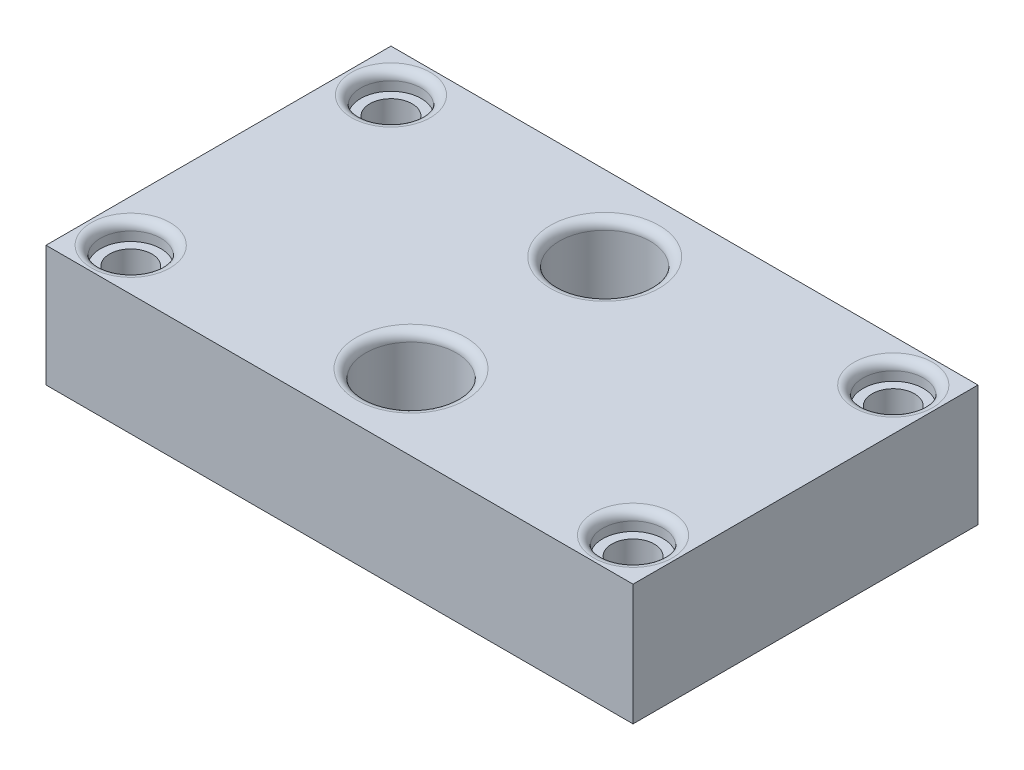
ISO-10303-21;
HEADER;
FILE_DESCRIPTION(('STEP AP214'),'2;1');
FILE_NAME('part.step','',(''),(''),'','','');
FILE_SCHEMA(('AUTOMOTIVE_DESIGN { 1 0 10303 214 1 1 1 1 }'));
ENDSEC;
DATA;
#1=APPLICATION_CONTEXT('core data for automotive mechanical design processes');
#2=APPLICATION_PROTOCOL_DEFINITION('international standard','automotive_design',2000,#1);
#3=PRODUCT_CONTEXT('',#1,'mechanical');
#4=PRODUCT('Part','Part','',(#3));
#5=PRODUCT_RELATED_PRODUCT_CATEGORY('part','',(#4));
#6=PRODUCT_DEFINITION_FORMATION('','',#4);
#7=PRODUCT_DEFINITION_CONTEXT('part definition',#1,'design');
#8=PRODUCT_DEFINITION('design','',#6,#7);
#9=PRODUCT_DEFINITION_SHAPE('','',#8);
#10=(LENGTH_UNIT() NAMED_UNIT(*) SI_UNIT(.MILLI.,.METRE.));
#11=(NAMED_UNIT(*) PLANE_ANGLE_UNIT() SI_UNIT($,.RADIAN.));
#12=(NAMED_UNIT(*) SI_UNIT($,.STERADIAN.) SOLID_ANGLE_UNIT());
#13=UNCERTAINTY_MEASURE_WITH_UNIT(LENGTH_MEASURE(1.E-05),#10,'distance_accuracy_value','');
#14=(GEOMETRIC_REPRESENTATION_CONTEXT(3) GLOBAL_UNCERTAINTY_ASSIGNED_CONTEXT((#13)) GLOBAL_UNIT_ASSIGNED_CONTEXT((#10,
#11,#12)) REPRESENTATION_CONTEXT('',''));
#15=CARTESIAN_POINT('',(0.,0.,0.));
#16=DIRECTION('',(0.,0.,1.));
#17=DIRECTION('',(1.,0.,0.));
#18=AXIS2_PLACEMENT_3D('',#15,#16,#17);
#19=CARTESIAN_POINT('',(-527.259361974666,535.957940223895,-28.5));
#20=DIRECTION('',(0.,0.,1.));
#21=DIRECTION('',(1.,0.,0.));
#22=AXIS2_PLACEMENT_3D('',#19,#20,#21);
#23=PLANE('',#22);
#24=DIRECTION('',(-1.,0.,0.));
#25=VECTOR('',#24,1.);
#26=CARTESIAN_POINT('',(-527.259361974666,515.957940223895,-28.5));
#27=LINE('',#26,#25);
#28=CARTESIAN_POINT('',(-527.259361974666,515.957940223895,-28.5));
#29=VERTEX_POINT('',#28);
#30=CARTESIAN_POINT('',(-624.259361974666,515.957940223895,-28.5));
#31=VERTEX_POINT('',#30);
#32=EDGE_CURVE('E100',#29,#31,#27,.T.);
#33=ORIENTED_EDGE('',*,*,#32,.T.);
#34=DIRECTION('',(0.,-1.,0.));
#35=VECTOR('',#34,1.);
#36=CARTESIAN_POINT('',(-624.259361974666,535.957940223895,-28.5));
#37=LINE('',#36,#35);
#38=CARTESIAN_POINT('',(-624.259361974666,535.957940223895,-28.5));
#39=VERTEX_POINT('',#38);
#40=EDGE_CURVE('E91',#39,#31,#37,.T.);
#41=ORIENTED_EDGE('',*,*,#40,.F.);
#42=DIRECTION('',(-1.,0.,0.));
#43=VECTOR('',#42,1.);
#44=CARTESIAN_POINT('',(-527.259361974666,535.957940223895,-28.5));
#45=LINE('',#44,#43);
#46=CARTESIAN_POINT('',(-527.259361974666,535.957940223895,-28.5));
#47=VERTEX_POINT('',#46);
#48=EDGE_CURVE('E85',#47,#39,#45,.T.);
#49=ORIENTED_EDGE('',*,*,#48,.F.);
#50=DIRECTION('',(0.,-1.,0.));
#51=VECTOR('',#50,1.);
#52=CARTESIAN_POINT('',(-527.259361974666,535.957940223895,-28.5));
#53=LINE('',#52,#51);
#54=EDGE_CURVE('E96',#47,#29,#53,.T.);
#55=ORIENTED_EDGE('',*,*,#54,.T.);
#56=EDGE_LOOP('',(#33,#41,#49,#55));
#57=FACE_BOUND('',#56,.T.);
#58=ADVANCED_FACE('F32',(#57),#23,.F.);
#59=CARTESIAN_POINT('',(-624.259361974666,535.957940223895,-28.5));
#60=DIRECTION('',(1.,0.,0.));
#61=DIRECTION('',(0.,0.,-1.));
#62=AXIS2_PLACEMENT_3D('',#59,#60,#61);
#63=PLANE('',#62);
#64=DIRECTION('',(0.,0.,1.));
#65=VECTOR('',#64,1.);
#66=CARTESIAN_POINT('',(-624.259361974666,515.957940223895,-28.5));
#67=LINE('',#66,#65);
#68=CARTESIAN_POINT('',(-624.259361974666,515.957940223895,28.5));
#69=VERTEX_POINT('',#68);
#70=EDGE_CURVE('E90',#31,#69,#67,.T.);
#71=ORIENTED_EDGE('',*,*,#70,.T.);
#72=DIRECTION('',(0.,-1.,0.));
#73=VECTOR('',#72,1.);
#74=CARTESIAN_POINT('',(-624.259361974666,535.957940223895,28.5));
#75=LINE('',#74,#73);
#76=CARTESIAN_POINT('',(-624.259361974666,535.957940223895,28.5));
#77=VERTEX_POINT('',#76);
#78=EDGE_CURVE('E88',#77,#69,#75,.T.);
#79=ORIENTED_EDGE('',*,*,#78,.F.);
#80=DIRECTION('',(0.,0.,1.));
#81=VECTOR('',#80,1.);
#82=CARTESIAN_POINT('',(-624.259361974666,535.957940223895,-28.5));
#83=LINE('',#82,#81);
#84=EDGE_CURVE('E80',#39,#77,#83,.T.);
#85=ORIENTED_EDGE('',*,*,#84,.F.);
#86=ORIENTED_EDGE('',*,*,#40,.T.);
#87=EDGE_LOOP('',(#71,#79,#85,#86));
#88=FACE_BOUND('',#87,.T.);
#89=ADVANCED_FACE('F89',(#88),#63,.F.);
#90=CARTESIAN_POINT('',(-624.259361974666,535.957940223895,28.5));
#91=DIRECTION('',(0.,0.,-1.));
#92=DIRECTION('',(-1.,0.,0.));
#93=AXIS2_PLACEMENT_3D('',#90,#91,#92);
#94=PLANE('',#93);
#95=DIRECTION('',(1.,0.,0.));
#96=VECTOR('',#95,1.);
#97=CARTESIAN_POINT('',(-624.259361974666,515.957940223895,28.5));
#98=LINE('',#97,#96);
#99=CARTESIAN_POINT('',(-527.259361974666,515.957940223895,28.5));
#100=VERTEX_POINT('',#99);
#101=EDGE_CURVE('E66',#69,#100,#98,.T.);
#102=ORIENTED_EDGE('',*,*,#101,.T.);
#103=DIRECTION('',(0.,-1.,0.));
#104=VECTOR('',#103,1.);
#105=CARTESIAN_POINT('',(-527.259361974666,535.957940223895,28.5));
#106=LINE('',#105,#104);
#107=CARTESIAN_POINT('',(-527.259361974666,535.957940223895,28.5));
#108=VERTEX_POINT('',#107);
#109=EDGE_CURVE('E92',#108,#100,#106,.T.);
#110=ORIENTED_EDGE('',*,*,#109,.F.);
#111=DIRECTION('',(1.,0.,0.));
#112=VECTOR('',#111,1.);
#113=CARTESIAN_POINT('',(-624.259361974666,535.957940223895,28.5));
#114=LINE('',#113,#112);
#115=EDGE_CURVE('E83',#77,#108,#114,.T.);
#116=ORIENTED_EDGE('',*,*,#115,.F.);
#117=ORIENTED_EDGE('',*,*,#78,.T.);
#118=EDGE_LOOP('',(#102,#110,#116,#117));
#119=FACE_BOUND('',#118,.T.);
#120=ADVANCED_FACE('F94',(#119),#94,.F.);
#121=CARTESIAN_POINT('',(-527.259361974666,535.957940223895,28.5));
#122=DIRECTION('',(-1.,0.,0.));
#123=DIRECTION('',(0.,0.,1.));
#124=AXIS2_PLACEMENT_3D('',#121,#122,#123);
#125=PLANE('',#124);
#126=DIRECTION('',(0.,0.,-1.));
#127=VECTOR('',#126,1.);
#128=CARTESIAN_POINT('',(-527.259361974666,515.957940223895,28.5));
#129=LINE('',#128,#127);
#130=EDGE_CURVE('E72',#100,#29,#129,.T.);
#131=ORIENTED_EDGE('',*,*,#130,.T.);
#132=ORIENTED_EDGE('',*,*,#54,.F.);
#133=DIRECTION('',(0.,0.,-1.));
#134=VECTOR('',#133,1.);
#135=CARTESIAN_POINT('',(-527.259361974666,535.957940223895,28.5));
#136=LINE('',#135,#134);
#137=EDGE_CURVE('E49',#108,#47,#136,.T.);
#138=ORIENTED_EDGE('',*,*,#137,.F.);
#139=ORIENTED_EDGE('',*,*,#109,.T.);
#140=EDGE_LOOP('',(#131,#132,#138,#139));
#141=FACE_BOUND('',#140,.T.);
#142=ADVANCED_FACE('F276',(#141),#125,.F.);
#143=CARTESIAN_POINT('',(0.,535.957940223895,0.));
#144=DIRECTION('',(0.,1.,0.));
#145=DIRECTION('',(0.,0.,1.));
#146=AXIS2_PLACEMENT_3D('',#143,#144,#145);
#147=PLANE('',#146);
#148=CARTESIAN_POINT('',(-617.259361974666,535.957940223895,21.5000000000001));
#149=DIRECTION('',(0.,1.,0.));
#150=DIRECTION('',(0.,0.,1.));
#151=AXIS2_PLACEMENT_3D('',#148,#149,#150);
#152=CIRCLE('',#151,6.50000000000004);
#153=CARTESIAN_POINT('',(-617.259361974666,535.957940223895,28.0000000000002));
#154=VERTEX_POINT('',#153);
#155=EDGE_CURVE('E142',#154,#154,#152,.F.);
#156=ORIENTED_EDGE('',*,*,#155,.T.);
#157=EDGE_LOOP('',(#156));
#158=FACE_BOUND('',#157,.T.);
#159=CARTESIAN_POINT('',(-617.259361974666,535.957940223895,-21.5000000000002));
#160=DIRECTION('',(0.,1.,0.));
#161=DIRECTION('',(0.,0.,1.));
#162=AXIS2_PLACEMENT_3D('',#159,#160,#161);
#163=CIRCLE('',#162,6.50000000000004);
#164=CARTESIAN_POINT('',(-617.259361974666,535.957940223895,-15.0000000000001));
#165=VERTEX_POINT('',#164);
#166=EDGE_CURVE('E139',#165,#165,#163,.F.);
#167=ORIENTED_EDGE('',*,*,#166,.T.);
#168=EDGE_LOOP('',(#167));
#169=FACE_BOUND('',#168,.T.);
#170=CARTESIAN_POINT('',(-534.259361974666,535.957940223895,-21.5));
#171=DIRECTION('',(0.,1.,0.));
#172=DIRECTION('',(0.,0.,1.));
#173=AXIS2_PLACEMENT_3D('',#170,#171,#172);
#174=CIRCLE('',#173,6.50000000000004);
#175=CARTESIAN_POINT('',(-534.259361974666,535.957940223895,-15.));
#176=VERTEX_POINT('',#175);
#177=EDGE_CURVE('E136',#176,#176,#174,.F.);
#178=ORIENTED_EDGE('',*,*,#177,.T.);
#179=EDGE_LOOP('',(#178));
#180=FACE_BOUND('',#179,.T.);
#181=CARTESIAN_POINT('',(-534.259361974666,535.957940223895,21.5));
#182=DIRECTION('',(0.,1.,0.));
#183=DIRECTION('',(0.,0.,1.));
#184=AXIS2_PLACEMENT_3D('',#181,#182,#183);
#185=CIRCLE('',#184,6.50000000000004);
#186=CARTESIAN_POINT('',(-534.259361974666,535.957940223895,28.));
#187=VERTEX_POINT('',#186);
#188=EDGE_CURVE('E133',#187,#187,#185,.F.);
#189=ORIENTED_EDGE('',*,*,#188,.T.);
#190=EDGE_LOOP('',(#189));
#191=FACE_BOUND('',#190,.T.);
#192=CARTESIAN_POINT('',(-576.441550420573,535.957940223895,16.));
#193=DIRECTION('',(0.,1.,0.));
#194=DIRECTION('',(0.,0.,1.));
#195=AXIS2_PLACEMENT_3D('',#192,#193,#194);
#196=CIRCLE('',#195,8.99999999999995);
#197=CARTESIAN_POINT('',(-576.441550420573,535.957940223895,25.));
#198=VERTEX_POINT('',#197);
#199=EDGE_CURVE('E130',#198,#198,#196,.F.);
#200=ORIENTED_EDGE('',*,*,#199,.T.);
#201=EDGE_LOOP('',(#200));
#202=FACE_BOUND('',#201,.T.);
#203=CARTESIAN_POINT('',(-576.441550420573,535.957940223895,-16.));
#204=DIRECTION('',(0.,1.,0.));
#205=DIRECTION('',(0.,0.,1.));
#206=AXIS2_PLACEMENT_3D('',#203,#204,#205);
#207=CIRCLE('',#206,8.99999999999995);
#208=CARTESIAN_POINT('',(-576.441550420573,535.957940223895,-7.00000000000002));
#209=VERTEX_POINT('',#208);
#210=EDGE_CURVE('E127',#209,#209,#207,.F.);
#211=ORIENTED_EDGE('',*,*,#210,.T.);
#212=EDGE_LOOP('',(#211));
#213=FACE_BOUND('',#212,.T.);
#214=ORIENTED_EDGE('',*,*,#48,.T.);
#215=ORIENTED_EDGE('',*,*,#84,.T.);
#216=ORIENTED_EDGE('',*,*,#115,.T.);
#217=ORIENTED_EDGE('',*,*,#137,.T.);
#218=EDGE_LOOP('',(#214,#215,#216,#217));
#219=FACE_BOUND('',#218,.T.);
#220=ADVANCED_FACE('F81',(#158,#169,#180,#191,#202,#213,#219),#147,.T.);
#221=CARTESIAN_POINT('',(0.,515.957940223895,0.));
#222=DIRECTION('',(0.,1.,0.));
#223=DIRECTION('',(0.,0.,1.));
#224=AXIS2_PLACEMENT_3D('',#221,#222,#223);
#225=PLANE('',#224);
#226=CARTESIAN_POINT('',(-576.441550420573,515.957940223895,-16.));
#227=DIRECTION('',(0.,1.,0.));
#228=DIRECTION('',(0.,0.,1.));
#229=AXIS2_PLACEMENT_3D('',#226,#227,#228);
#230=CIRCLE('',#229,7.49999999999995);
#231=CARTESIAN_POINT('',(-576.441550420573,515.957940223895,-8.50000000000002));
#232=VERTEX_POINT('',#231);
#233=EDGE_CURVE('E406',#232,#232,#230,.T.);
#234=ORIENTED_EDGE('',*,*,#233,.T.);
#235=EDGE_LOOP('',(#234));
#236=FACE_BOUND('',#235,.T.);
#237=CARTESIAN_POINT('',(-576.441550420573,515.957940223895,16.));
#238=DIRECTION('',(0.,1.,0.));
#239=DIRECTION('',(0.,0.,1.));
#240=AXIS2_PLACEMENT_3D('',#237,#238,#239);
#241=CIRCLE('',#240,7.49999999999995);
#242=CARTESIAN_POINT('',(-576.441550420573,515.957940223895,23.5));
#243=VERTEX_POINT('',#242);
#244=EDGE_CURVE('E407',#243,#243,#241,.T.);
#245=ORIENTED_EDGE('',*,*,#244,.T.);
#246=EDGE_LOOP('',(#245));
#247=FACE_BOUND('',#246,.T.);
#248=ORIENTED_EDGE('',*,*,#32,.F.);
#249=ORIENTED_EDGE('',*,*,#130,.F.);
#250=ORIENTED_EDGE('',*,*,#101,.F.);
#251=ORIENTED_EDGE('',*,*,#70,.F.);
#252=EDGE_LOOP('',(#248,#249,#250,#251));
#253=FACE_BOUND('',#252,.T.);
#254=ADVANCED_FACE('F275',(#236,#247,#253),#225,.F.);
#255=CARTESIAN_POINT('',(-617.259361974666,532.957940223895,-21.5000000000002));
#256=DIRECTION('',(0.,1.,0.));
#257=DIRECTION('',(0.,0.,1.));
#258=AXIS2_PLACEMENT_3D('',#255,#256,#257);
#259=PLANE('',#258);
#260=CARTESIAN_POINT('',(-617.259361974666,532.957940223895,-21.5000000000002));
#261=DIRECTION('',(0.,1.,0.));
#262=DIRECTION('',(0.,0.,1.));
#263=AXIS2_PLACEMENT_3D('',#260,#261,#262);
#264=CIRCLE('',#263,5.00000000000004);
#265=CARTESIAN_POINT('',(-617.259361974666,532.957940223895,-16.5000000000001));
#266=VERTEX_POINT('',#265);
#267=EDGE_CURVE('E207',#266,#266,#264,.T.);
#268=ORIENTED_EDGE('',*,*,#267,.T.);
#269=EDGE_LOOP('',(#268));
#270=FACE_BOUND('',#269,.T.);
#271=CARTESIAN_POINT('',(-617.259361974666,532.957940223895,-21.5000000000002));
#272=DIRECTION('',(0.,1.,0.));
#273=DIRECTION('',(0.,0.,1.));
#274=AXIS2_PLACEMENT_3D('',#271,#272,#273);
#275=CIRCLE('',#274,3.49999999999997);
#276=CARTESIAN_POINT('',(-617.259361974666,532.957940223895,-18.0000000000002));
#277=VERTEX_POINT('',#276);
#278=EDGE_CURVE('E111',#277,#277,#275,.F.);
#279=ORIENTED_EDGE('',*,*,#278,.T.);
#280=EDGE_LOOP('',(#279));
#281=FACE_BOUND('',#280,.T.);
#282=ADVANCED_FACE('F280',(#270,#281),#259,.T.);
#283=CARTESIAN_POINT('',(-617.259361974666,532.957940223895,-21.5000000000002));
#284=DIRECTION('',(0.,1.,0.));
#285=DIRECTION('',(0.,0.,1.));
#286=AXIS2_PLACEMENT_3D('',#283,#284,#285);
#287=CYLINDRICAL_SURFACE('',#286,5.00000000000004);
#288=CARTESIAN_POINT('',(-617.259361974666,534.457940223895,-21.5000000000002));
#289=DIRECTION('',(0.,1.,0.));
#290=DIRECTION('',(0.,0.,1.));
#291=AXIS2_PLACEMENT_3D('',#288,#289,#290);
#292=CIRCLE('',#291,5.00000000000004);
#293=CARTESIAN_POINT('',(-617.259361974666,534.457940223895,-16.5000000000001));
#294=VERTEX_POINT('',#293);
#295=EDGE_CURVE('E145',#294,#294,#292,.T.);
#296=ORIENTED_EDGE('',*,*,#295,.T.);
#297=EDGE_LOOP('',(#296));
#298=FACE_BOUND('',#297,.T.);
#299=ORIENTED_EDGE('',*,*,#267,.F.);
#300=EDGE_LOOP('',(#299));
#301=FACE_BOUND('',#300,.T.);
#302=ADVANCED_FACE('F309',(#298,#301),#287,.F.);
#303=CARTESIAN_POINT('',(-534.259361974666,532.957940223895,21.5));
#304=DIRECTION('',(0.,1.,0.));
#305=DIRECTION('',(0.,0.,1.));
#306=AXIS2_PLACEMENT_3D('',#303,#304,#305);
#307=PLANE('',#306);
#308=CARTESIAN_POINT('',(-534.259361974666,532.957940223895,21.5));
#309=DIRECTION('',(0.,1.,0.));
#310=DIRECTION('',(0.,0.,1.));
#311=AXIS2_PLACEMENT_3D('',#308,#309,#310);
#312=CIRCLE('',#311,5.00000000000004);
#313=CARTESIAN_POINT('',(-534.259361974666,532.957940223895,26.5));
#314=VERTEX_POINT('',#313);
#315=EDGE_CURVE('E214',#314,#314,#312,.T.);
#316=ORIENTED_EDGE('',*,*,#315,.T.);
#317=EDGE_LOOP('',(#316));
#318=FACE_BOUND('',#317,.T.);
#319=CARTESIAN_POINT('',(-534.259361974666,532.957940223895,21.5));
#320=DIRECTION('',(0.,1.,0.));
#321=DIRECTION('',(0.,0.,1.));
#322=AXIS2_PLACEMENT_3D('',#319,#320,#321);
#323=CIRCLE('',#322,3.49999999999996);
#324=CARTESIAN_POINT('',(-534.259361974666,532.957940223895,24.9999999999999));
#325=VERTEX_POINT('',#324);
#326=EDGE_CURVE('E114',#325,#325,#323,.F.);
#327=ORIENTED_EDGE('',*,*,#326,.T.);
#328=EDGE_LOOP('',(#327));
#329=FACE_BOUND('',#328,.T.);
#330=ADVANCED_FACE('F318',(#318,#329),#307,.T.);
#331=CARTESIAN_POINT('',(-534.259361974666,532.957940223895,21.5));
#332=DIRECTION('',(0.,1.,0.));
#333=DIRECTION('',(0.,0.,1.));
#334=AXIS2_PLACEMENT_3D('',#331,#332,#333);
#335=CYLINDRICAL_SURFACE('',#334,5.00000000000004);
#336=CARTESIAN_POINT('',(-534.259361974666,534.457940223895,21.5));
#337=DIRECTION('',(0.,1.,0.));
#338=DIRECTION('',(0.,0.,1.));
#339=AXIS2_PLACEMENT_3D('',#336,#337,#338);
#340=CIRCLE('',#339,5.00000000000004);
#341=CARTESIAN_POINT('',(-534.259361974666,534.457940223895,26.5));
#342=VERTEX_POINT('',#341);
#343=EDGE_CURVE('E151',#342,#342,#340,.T.);
#344=ORIENTED_EDGE('',*,*,#343,.T.);
#345=EDGE_LOOP('',(#344));
#346=FACE_BOUND('',#345,.T.);
#347=ORIENTED_EDGE('',*,*,#315,.F.);
#348=EDGE_LOOP('',(#347));
#349=FACE_BOUND('',#348,.T.);
#350=ADVANCED_FACE('F245',(#346,#349),#335,.F.);
#351=CARTESIAN_POINT('',(-617.259361974666,532.957940223895,21.5000000000001));
#352=DIRECTION('',(0.,1.,0.));
#353=DIRECTION('',(0.,0.,1.));
#354=AXIS2_PLACEMENT_3D('',#351,#352,#353);
#355=PLANE('',#354);
#356=CARTESIAN_POINT('',(-617.259361974666,532.957940223895,21.5000000000001));
#357=DIRECTION('',(0.,1.,0.));
#358=DIRECTION('',(0.,0.,1.));
#359=AXIS2_PLACEMENT_3D('',#356,#357,#358);
#360=CIRCLE('',#359,5.00000000000004);
#361=CARTESIAN_POINT('',(-617.259361974666,532.957940223895,26.5000000000002));
#362=VERTEX_POINT('',#361);
#363=EDGE_CURVE('E210',#362,#362,#360,.T.);
#364=ORIENTED_EDGE('',*,*,#363,.T.);
#365=EDGE_LOOP('',(#364));
#366=FACE_BOUND('',#365,.T.);
#367=CARTESIAN_POINT('',(-617.259361974666,532.957940223895,21.5000000000001));
#368=DIRECTION('',(0.,1.,0.));
#369=DIRECTION('',(0.,0.,1.));
#370=AXIS2_PLACEMENT_3D('',#367,#368,#369);
#371=CIRCLE('',#370,3.49999999999997);
#372=CARTESIAN_POINT('',(-617.259361974666,532.957940223895,25.0000000000001));
#373=VERTEX_POINT('',#372);
#374=EDGE_CURVE('E118',#373,#373,#371,.F.);
#375=ORIENTED_EDGE('',*,*,#374,.T.);
#376=EDGE_LOOP('',(#375));
#377=FACE_BOUND('',#376,.T.);
#378=ADVANCED_FACE('F241',(#366,#377),#355,.T.);
#379=CARTESIAN_POINT('',(-617.259361974666,532.957940223895,21.5000000000001));
#380=DIRECTION('',(0.,1.,0.));
#381=DIRECTION('',(0.,0.,1.));
#382=AXIS2_PLACEMENT_3D('',#379,#380,#381);
#383=CYLINDRICAL_SURFACE('',#382,5.00000000000004);
#384=CARTESIAN_POINT('',(-617.259361974666,534.457940223895,21.5000000000001));
#385=DIRECTION('',(0.,1.,0.));
#386=DIRECTION('',(0.,0.,1.));
#387=AXIS2_PLACEMENT_3D('',#384,#385,#386);
#388=CIRCLE('',#387,5.00000000000004);
#389=CARTESIAN_POINT('',(-617.259361974666,534.457940223895,26.5000000000002));
#390=VERTEX_POINT('',#389);
#391=EDGE_CURVE('E110',#390,#390,#388,.T.);
#392=ORIENTED_EDGE('',*,*,#391,.T.);
#393=EDGE_LOOP('',(#392));
#394=FACE_BOUND('',#393,.T.);
#395=ORIENTED_EDGE('',*,*,#363,.F.);
#396=EDGE_LOOP('',(#395));
#397=FACE_BOUND('',#396,.T.);
#398=ADVANCED_FACE('F236',(#394,#397),#383,.F.);
#399=CARTESIAN_POINT('',(-534.259361974666,532.957940223895,-21.5));
#400=DIRECTION('',(0.,1.,0.));
#401=DIRECTION('',(0.,0.,1.));
#402=AXIS2_PLACEMENT_3D('',#399,#400,#401);
#403=PLANE('',#402);
#404=CARTESIAN_POINT('',(-534.259361974666,532.957940223895,-21.5));
#405=DIRECTION('',(0.,1.,0.));
#406=DIRECTION('',(0.,0.,1.));
#407=AXIS2_PLACEMENT_3D('',#404,#405,#406);
#408=CIRCLE('',#407,5.00000000000004);
#409=CARTESIAN_POINT('',(-534.259361974666,532.957940223895,-16.5));
#410=VERTEX_POINT('',#409);
#411=EDGE_CURVE('E115',#410,#410,#408,.T.);
#412=ORIENTED_EDGE('',*,*,#411,.T.);
#413=EDGE_LOOP('',(#412));
#414=FACE_BOUND('',#413,.T.);
#415=CARTESIAN_POINT('',(-534.259361974666,532.957940223895,-21.5));
#416=DIRECTION('',(0.,1.,0.));
#417=DIRECTION('',(0.,0.,1.));
#418=AXIS2_PLACEMENT_3D('',#415,#416,#417);
#419=CIRCLE('',#418,3.49999999999996);
#420=CARTESIAN_POINT('',(-534.259361974666,532.957940223895,-18.0000000000001));
#421=VERTEX_POINT('',#420);
#422=EDGE_CURVE('E121',#421,#421,#419,.F.);
#423=ORIENTED_EDGE('',*,*,#422,.T.);
#424=EDGE_LOOP('',(#423));
#425=FACE_BOUND('',#424,.T.);
#426=ADVANCED_FACE('F202',(#414,#425),#403,.T.);
#427=CARTESIAN_POINT('',(-534.259361974666,532.957940223895,-21.5));
#428=DIRECTION('',(0.,1.,0.));
#429=DIRECTION('',(0.,0.,1.));
#430=AXIS2_PLACEMENT_3D('',#427,#428,#429);
#431=CYLINDRICAL_SURFACE('',#430,5.00000000000004);
#432=CARTESIAN_POINT('',(-534.259361974666,534.457940223895,-21.5));
#433=DIRECTION('',(0.,1.,0.));
#434=DIRECTION('',(0.,0.,1.));
#435=AXIS2_PLACEMENT_3D('',#432,#433,#434);
#436=CIRCLE('',#435,5.00000000000004);
#437=CARTESIAN_POINT('',(-534.259361974666,534.457940223895,-16.5));
#438=VERTEX_POINT('',#437);
#439=EDGE_CURVE('E148',#438,#438,#436,.T.);
#440=ORIENTED_EDGE('',*,*,#439,.T.);
#441=EDGE_LOOP('',(#440));
#442=FACE_BOUND('',#441,.T.);
#443=ORIENTED_EDGE('',*,*,#411,.F.);
#444=EDGE_LOOP('',(#443));
#445=FACE_BOUND('',#444,.T.);
#446=ADVANCED_FACE('F198',(#442,#445),#431,.F.);
#447=CARTESIAN_POINT('',(-617.259361974666,525.957940223895,-21.5000000000002));
#448=DIRECTION('',(0.,-1.,0.));
#449=DIRECTION('',(0.,0.,-1.));
#450=AXIS2_PLACEMENT_3D('',#447,#448,#449);
#451=PLANE('',#450);
#452=CARTESIAN_POINT('',(-617.259361974666,525.957940223895,-21.5000000000002));
#453=DIRECTION('',(0.,1.,0.));
#454=DIRECTION('',(0.,0.,-1.));
#455=AXIS2_PLACEMENT_3D('',#452,#453,#454);
#456=CIRCLE('',#455,3.49999999999997);
#457=CARTESIAN_POINT('',(-617.259361974666,525.957940223895,-25.0000000000002));
#458=VERTEX_POINT('',#457);
#459=EDGE_CURVE('E219',#458,#458,#456,.T.);
#460=ORIENTED_EDGE('',*,*,#459,.T.);
#461=EDGE_LOOP('',(#460));
#462=FACE_BOUND('',#461,.T.);
#463=ADVANCED_FACE('F201',(#462),#451,.F.);
#464=CARTESIAN_POINT('',(-617.259361974666,525.957940223895,-21.5000000000002));
#465=DIRECTION('',(0.,1.,0.));
#466=DIRECTION('',(0.,0.,1.));
#467=AXIS2_PLACEMENT_3D('',#464,#465,#466);
#468=CYLINDRICAL_SURFACE('',#467,3.49999999999997);
#469=ORIENTED_EDGE('',*,*,#459,.F.);
#470=EDGE_LOOP('',(#469));
#471=FACE_BOUND('',#470,.T.);
#472=ORIENTED_EDGE('',*,*,#278,.F.);
#473=EDGE_LOOP('',(#472));
#474=FACE_BOUND('',#473,.T.);
#475=ADVANCED_FACE('F259',(#471,#474),#468,.F.);
#476=CARTESIAN_POINT('',(-534.259361974666,525.957940223895,21.5));
#477=DIRECTION('',(0.,-1.,0.));
#478=DIRECTION('',(0.,0.,-1.));
#479=AXIS2_PLACEMENT_3D('',#476,#477,#478);
#480=PLANE('',#479);
#481=CARTESIAN_POINT('',(-534.259361974666,525.957940223895,21.5));
#482=DIRECTION('',(0.,1.,0.));
#483=DIRECTION('',(0.,0.,-1.));
#484=AXIS2_PLACEMENT_3D('',#481,#482,#483);
#485=CIRCLE('',#484,3.49999999999996);
#486=CARTESIAN_POINT('',(-534.259361974666,525.957940223895,18.));
#487=VERTEX_POINT('',#486);
#488=EDGE_CURVE('E218',#487,#487,#485,.T.);
#489=ORIENTED_EDGE('',*,*,#488,.T.);
#490=EDGE_LOOP('',(#489));
#491=FACE_BOUND('',#490,.T.);
#492=ADVANCED_FACE('F263',(#491),#480,.F.);
#493=CARTESIAN_POINT('',(-534.259361974666,525.957940223895,21.5));
#494=DIRECTION('',(0.,1.,0.));
#495=DIRECTION('',(0.,0.,1.));
#496=AXIS2_PLACEMENT_3D('',#493,#494,#495);
#497=CYLINDRICAL_SURFACE('',#496,3.49999999999996);
#498=ORIENTED_EDGE('',*,*,#488,.F.);
#499=EDGE_LOOP('',(#498));
#500=FACE_BOUND('',#499,.T.);
#501=ORIENTED_EDGE('',*,*,#326,.F.);
#502=EDGE_LOOP('',(#501));
#503=FACE_BOUND('',#502,.T.);
#504=ADVANCED_FACE('F252',(#500,#503),#497,.F.);
#505=CARTESIAN_POINT('',(-617.259361974666,525.957940223895,21.5000000000001));
#506=DIRECTION('',(0.,1.,0.));
#507=DIRECTION('',(0.,0.,1.));
#508=AXIS2_PLACEMENT_3D('',#505,#506,#507);
#509=PLANE('',#508);
#510=CARTESIAN_POINT('',(-617.259361974666,525.957940223895,21.5000000000001));
#511=DIRECTION('',(0.,1.,0.));
#512=DIRECTION('',(0.,0.,1.));
#513=AXIS2_PLACEMENT_3D('',#510,#511,#512);
#514=CIRCLE('',#513,3.49999999999997);
#515=CARTESIAN_POINT('',(-617.259361974666,525.957940223895,25.0000000000001));
#516=VERTEX_POINT('',#515);
#517=EDGE_CURVE('E124',#516,#516,#514,.T.);
#518=ORIENTED_EDGE('',*,*,#517,.T.);
#519=EDGE_LOOP('',(#518));
#520=FACE_BOUND('',#519,.T.);
#521=ADVANCED_FACE('F248',(#520),#509,.T.);
#522=CARTESIAN_POINT('',(-617.259361974666,525.957940223895,21.5000000000001));
#523=DIRECTION('',(0.,1.,0.));
#524=DIRECTION('',(0.,0.,1.));
#525=AXIS2_PLACEMENT_3D('',#522,#523,#524);
#526=CYLINDRICAL_SURFACE('',#525,3.49999999999997);
#527=ORIENTED_EDGE('',*,*,#517,.F.);
#528=EDGE_LOOP('',(#527));
#529=FACE_BOUND('',#528,.T.);
#530=ORIENTED_EDGE('',*,*,#374,.F.);
#531=EDGE_LOOP('',(#530));
#532=FACE_BOUND('',#531,.T.);
#533=ADVANCED_FACE('F251',(#529,#532),#526,.F.);
#534=CARTESIAN_POINT('',(-534.259361974666,525.957940223895,-21.5));
#535=DIRECTION('',(0.,1.,0.));
#536=DIRECTION('',(0.,0.,1.));
#537=AXIS2_PLACEMENT_3D('',#534,#535,#536);
#538=PLANE('',#537);
#539=CARTESIAN_POINT('',(-534.259361974666,525.957940223895,-21.5));
#540=DIRECTION('',(0.,1.,0.));
#541=DIRECTION('',(0.,0.,1.));
#542=AXIS2_PLACEMENT_3D('',#539,#540,#541);
#543=CIRCLE('',#542,3.49999999999996);
#544=CARTESIAN_POINT('',(-534.259361974666,525.957940223895,-18.0000000000001));
#545=VERTEX_POINT('',#544);
#546=EDGE_CURVE('E103',#545,#545,#543,.T.);
#547=ORIENTED_EDGE('',*,*,#546,.T.);
#548=EDGE_LOOP('',(#547));
#549=FACE_BOUND('',#548,.T.);
#550=ADVANCED_FACE('F227',(#549),#538,.T.);
#551=CARTESIAN_POINT('',(-534.259361974666,525.957940223895,-21.5));
#552=DIRECTION('',(0.,1.,0.));
#553=DIRECTION('',(0.,0.,1.));
#554=AXIS2_PLACEMENT_3D('',#551,#552,#553);
#555=CYLINDRICAL_SURFACE('',#554,3.49999999999996);
#556=ORIENTED_EDGE('',*,*,#546,.F.);
#557=EDGE_LOOP('',(#556));
#558=FACE_BOUND('',#557,.T.);
#559=ORIENTED_EDGE('',*,*,#422,.F.);
#560=EDGE_LOOP('',(#559));
#561=FACE_BOUND('',#560,.T.);
#562=ADVANCED_FACE('F229',(#558,#561),#555,.F.);
#563=CARTESIAN_POINT('',(-576.441550420573,515.957940223895,16.));
#564=DIRECTION('',(0.,1.,0.));
#565=DIRECTION('',(0.,0.,1.));
#566=AXIS2_PLACEMENT_3D('',#563,#564,#565);
#567=CYLINDRICAL_SURFACE('',#566,7.49999999999995);
#568=CARTESIAN_POINT('',(-576.441550420573,534.457940223895,16.));
#569=DIRECTION('',(0.,1.,0.));
#570=DIRECTION('',(0.,0.,1.));
#571=AXIS2_PLACEMENT_3D('',#568,#569,#570);
#572=CIRCLE('',#571,7.49999999999995);
#573=CARTESIAN_POINT('',(-576.441550420573,534.457940223895,23.5));
#574=VERTEX_POINT('',#573);
#575=EDGE_CURVE('E41',#574,#574,#572,.T.);
#576=ORIENTED_EDGE('',*,*,#575,.T.);
#577=EDGE_LOOP('',(#576));
#578=FACE_BOUND('',#577,.T.);
#579=ORIENTED_EDGE('',*,*,#244,.F.);
#580=EDGE_LOOP('',(#579));
#581=FACE_BOUND('',#580,.T.);
#582=ADVANCED_FACE('F156',(#578,#581),#567,.F.);
#583=CARTESIAN_POINT('',(-576.441550420573,515.957940223895,-16.));
#584=DIRECTION('',(0.,1.,0.));
#585=DIRECTION('',(0.,0.,1.));
#586=AXIS2_PLACEMENT_3D('',#583,#584,#585);
#587=CYLINDRICAL_SURFACE('',#586,7.49999999999995);
#588=CARTESIAN_POINT('',(-576.441550420573,534.457940223895,-16.));
#589=DIRECTION('',(0.,1.,0.));
#590=DIRECTION('',(0.,0.,1.));
#591=AXIS2_PLACEMENT_3D('',#588,#589,#590);
#592=CIRCLE('',#591,7.49999999999995);
#593=CARTESIAN_POINT('',(-576.441550420573,534.457940223895,-8.50000000000002));
#594=VERTEX_POINT('',#593);
#595=EDGE_CURVE('E11',#594,#594,#592,.T.);
#596=ORIENTED_EDGE('',*,*,#595,.T.);
#597=EDGE_LOOP('',(#596));
#598=FACE_BOUND('',#597,.T.);
#599=ORIENTED_EDGE('',*,*,#233,.F.);
#600=EDGE_LOOP('',(#599));
#601=FACE_BOUND('',#600,.T.);
#602=ADVANCED_FACE('F185',(#598,#601),#587,.F.);
#603=CARTESIAN_POINT('',(-617.259361974666,534.457940223895,21.5000000000001));
#604=DIRECTION('',(0.,1.,0.));
#605=DIRECTION('',(0.,0.,1.));
#606=AXIS2_PLACEMENT_3D('',#603,#604,#605);
#607=TOROIDAL_SURFACE('',#606,6.50000000000004,1.5);
#608=ORIENTED_EDGE('',*,*,#155,.F.);
#609=EDGE_LOOP('',(#608));
#610=FACE_BOUND('',#609,.T.);
#611=ORIENTED_EDGE('',*,*,#391,.F.);
#612=EDGE_LOOP('',(#611));
#613=FACE_BOUND('',#612,.T.);
#614=ADVANCED_FACE('F181',(#610,#613),#607,.T.);
#615=CARTESIAN_POINT('',(-617.259361974666,534.457940223895,-21.5000000000002));
#616=DIRECTION('',(0.,1.,0.));
#617=DIRECTION('',(0.,0.,1.));
#618=AXIS2_PLACEMENT_3D('',#615,#616,#617);
#619=TOROIDAL_SURFACE('',#618,6.50000000000004,1.5);
#620=ORIENTED_EDGE('',*,*,#166,.F.);
#621=EDGE_LOOP('',(#620));
#622=FACE_BOUND('',#621,.T.);
#623=ORIENTED_EDGE('',*,*,#295,.F.);
#624=EDGE_LOOP('',(#623));
#625=FACE_BOUND('',#624,.T.);
#626=ADVANCED_FACE('F184',(#622,#625),#619,.T.);
#627=CARTESIAN_POINT('',(-534.259361974666,534.457940223895,-21.5));
#628=DIRECTION('',(0.,1.,0.));
#629=DIRECTION('',(0.,0.,1.));
#630=AXIS2_PLACEMENT_3D('',#627,#628,#629);
#631=TOROIDAL_SURFACE('',#630,6.50000000000004,1.5);
#632=ORIENTED_EDGE('',*,*,#177,.F.);
#633=EDGE_LOOP('',(#632));
#634=FACE_BOUND('',#633,.T.);
#635=ORIENTED_EDGE('',*,*,#439,.F.);
#636=EDGE_LOOP('',(#635));
#637=FACE_BOUND('',#636,.T.);
#638=ADVANCED_FACE('F168',(#634,#637),#631,.T.);
#639=CARTESIAN_POINT('',(-534.259361974666,534.457940223895,21.5));
#640=DIRECTION('',(0.,1.,0.));
#641=DIRECTION('',(0.,0.,1.));
#642=AXIS2_PLACEMENT_3D('',#639,#640,#641);
#643=TOROIDAL_SURFACE('',#642,6.50000000000004,1.5);
#644=ORIENTED_EDGE('',*,*,#188,.F.);
#645=EDGE_LOOP('',(#644));
#646=FACE_BOUND('',#645,.T.);
#647=ORIENTED_EDGE('',*,*,#343,.F.);
#648=EDGE_LOOP('',(#647));
#649=FACE_BOUND('',#648,.T.);
#650=ADVANCED_FACE('F161',(#646,#649),#643,.T.);
#651=CARTESIAN_POINT('',(-576.441550420573,534.457940223895,16.));
#652=DIRECTION('',(0.,1.,0.));
#653=DIRECTION('',(0.,0.,1.));
#654=AXIS2_PLACEMENT_3D('',#651,#652,#653);
#655=TOROIDAL_SURFACE('',#654,8.99999999999995,1.5);
#656=ORIENTED_EDGE('',*,*,#199,.F.);
#657=EDGE_LOOP('',(#656));
#658=FACE_BOUND('',#657,.T.);
#659=ORIENTED_EDGE('',*,*,#575,.F.);
#660=EDGE_LOOP('',(#659));
#661=FACE_BOUND('',#660,.T.);
#662=ADVANCED_FACE('F159',(#658,#661),#655,.T.);
#663=CARTESIAN_POINT('',(-576.441550420573,534.457940223895,-16.));
#664=DIRECTION('',(0.,1.,0.));
#665=DIRECTION('',(0.,0.,1.));
#666=AXIS2_PLACEMENT_3D('',#663,#664,#665);
#667=TOROIDAL_SURFACE('',#666,8.99999999999995,1.5);
#668=ORIENTED_EDGE('',*,*,#210,.F.);
#669=EDGE_LOOP('',(#668));
#670=FACE_BOUND('',#669,.T.);
#671=ORIENTED_EDGE('',*,*,#595,.F.);
#672=EDGE_LOOP('',(#671));
#673=FACE_BOUND('',#672,.T.);
#674=ADVANCED_FACE('F34',(#670,#673),#667,.T.);
#675=CLOSED_SHELL('',(#58,#89,#120,#142,#220,#254,#282,#302,#330,#350,#378,#398,#426,#446,#463,
#475,#492,#504,#521,#533,#550,#562,#582,#602,#614,#626,#638,#650,#662,#674));
#676=MANIFOLD_SOLID_BREP('B2',#675);
#677=ADVANCED_BREP_SHAPE_REPRESENTATION('',(#18,#676),#14);
#678=SHAPE_DEFINITION_REPRESENTATION(#9,#677);
ENDSEC;
END-ISO-10303-21;
